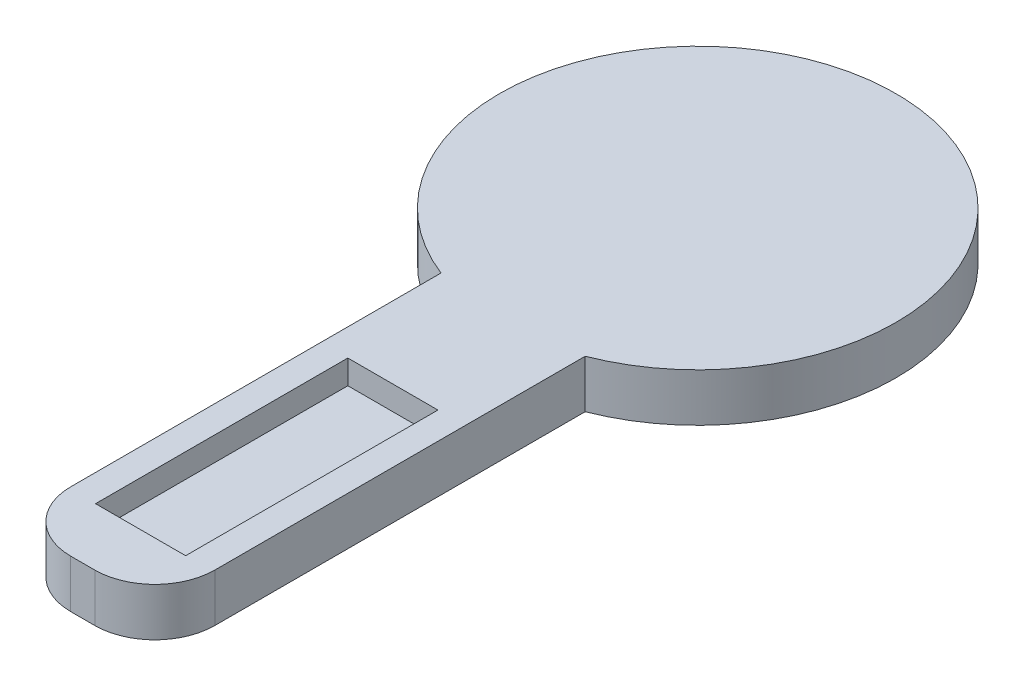
ISO-10303-21;
HEADER;
FILE_DESCRIPTION(('STEP AP214'),'2;1');
FILE_NAME('part.step','',(''),(''),'','','');
FILE_SCHEMA(('AUTOMOTIVE_DESIGN { 1 0 10303 214 1 1 1 1 }'));
ENDSEC;
DATA;
#1=APPLICATION_CONTEXT('core data for automotive mechanical design processes');
#2=APPLICATION_PROTOCOL_DEFINITION('international standard','automotive_design',2000,#1);
#3=PRODUCT_CONTEXT('',#1,'mechanical');
#4=PRODUCT('Part','Part','',(#3));
#5=PRODUCT_RELATED_PRODUCT_CATEGORY('part','',(#4));
#6=PRODUCT_DEFINITION_FORMATION('','',#4);
#7=PRODUCT_DEFINITION_CONTEXT('part definition',#1,'design');
#8=PRODUCT_DEFINITION('design','',#6,#7);
#9=PRODUCT_DEFINITION_SHAPE('','',#8);
#10=(LENGTH_UNIT() NAMED_UNIT(*) SI_UNIT(.MILLI.,.METRE.));
#11=(NAMED_UNIT(*) PLANE_ANGLE_UNIT() SI_UNIT($,.RADIAN.));
#12=(NAMED_UNIT(*) SI_UNIT($,.STERADIAN.) SOLID_ANGLE_UNIT());
#13=UNCERTAINTY_MEASURE_WITH_UNIT(LENGTH_MEASURE(1.E-05),#10,'distance_accuracy_value','');
#14=(GEOMETRIC_REPRESENTATION_CONTEXT(3) GLOBAL_UNCERTAINTY_ASSIGNED_CONTEXT((#13)) GLOBAL_UNIT_ASSIGNED_CONTEXT((#10,
#11,#12)) REPRESENTATION_CONTEXT('',''));
#15=CARTESIAN_POINT('',(0.,0.,0.));
#16=DIRECTION('',(0.,0.,1.));
#17=DIRECTION('',(1.,0.,0.));
#18=AXIS2_PLACEMENT_3D('',#15,#16,#17);
#19=CARTESIAN_POINT('',(-5.99999999999999,4.,-30.));
#20=DIRECTION('',(1.,0.,0.));
#21=DIRECTION('',(0.,0.,-1.));
#22=AXIS2_PLACEMENT_3D('',#19,#20,#21);
#23=PLANE('',#22);
#24=DIRECTION('',(0.,0.,1.));
#25=VECTOR('',#24,1.);
#26=CARTESIAN_POINT('',(-5.99999999999999,0.,-30.));
#27=LINE('',#26,#25);
#28=CARTESIAN_POINT('',(-5.99999999999999,0.,-5.8195738510606));
#29=VERTEX_POINT('',#28);
#30=CARTESIAN_POINT('',(-5.99999999999999,0.,25.));
#31=VERTEX_POINT('',#30);
#32=EDGE_CURVE('E149',#29,#31,#27,.T.);
#33=ORIENTED_EDGE('',*,*,#32,.T.);
#34=DIRECTION('',(0.,-1.,0.));
#35=VECTOR('',#34,1.);
#36=CARTESIAN_POINT('',(-5.99999999999999,4.,25.));
#37=LINE('',#36,#35);
#38=CARTESIAN_POINT('',(-5.99999999999999,4.,25.));
#39=VERTEX_POINT('',#38);
#40=EDGE_CURVE('E11',#31,#39,#37,.F.);
#41=ORIENTED_EDGE('',*,*,#40,.T.);
#42=DIRECTION('',(0.,0.,1.));
#43=VECTOR('',#42,1.);
#44=CARTESIAN_POINT('',(-5.99999999999999,4.,-30.));
#45=LINE('',#44,#43);
#46=CARTESIAN_POINT('',(-5.99999999999999,4.,-5.8195738510606));
#47=VERTEX_POINT('',#46);
#48=EDGE_CURVE('E133',#47,#39,#45,.T.);
#49=ORIENTED_EDGE('',*,*,#48,.F.);
#50=DIRECTION('',(0.,1.,0.));
#51=VECTOR('',#50,1.);
#52=CARTESIAN_POINT('',(-5.99999999999999,0.,-5.8195738510606));
#53=LINE('',#52,#51);
#54=EDGE_CURVE('E144',#47,#29,#53,.F.);
#55=ORIENTED_EDGE('',*,*,#54,.T.);
#56=EDGE_LOOP('',(#33,#41,#49,#55));
#57=FACE_BOUND('',#56,.T.);
#58=ADVANCED_FACE('F42',(#57),#23,.F.);
#59=CARTESIAN_POINT('',(-5.99999999999999,4.,30.));
#60=DIRECTION('',(0.,0.,-1.));
#61=DIRECTION('',(-1.,0.,0.));
#62=AXIS2_PLACEMENT_3D('',#59,#60,#61);
#63=PLANE('',#62);
#64=DIRECTION('',(1.,0.,0.));
#65=VECTOR('',#64,1.);
#66=CARTESIAN_POINT('',(-5.99999999999999,0.,30.));
#67=LINE('',#66,#65);
#68=CARTESIAN_POINT('',(-0.999999999999985,0.,30.));
#69=VERTEX_POINT('',#68);
#70=CARTESIAN_POINT('',(1.00000000000001,0.,30.));
#71=VERTEX_POINT('',#70);
#72=EDGE_CURVE('E134',#69,#71,#67,.T.);
#73=ORIENTED_EDGE('',*,*,#72,.T.);
#74=DIRECTION('',(0.,-1.,0.));
#75=VECTOR('',#74,1.);
#76=CARTESIAN_POINT('',(1.00000000000001,4.,30.));
#77=LINE('',#76,#75);
#78=CARTESIAN_POINT('',(1.00000000000001,4.,30.));
#79=VERTEX_POINT('',#78);
#80=EDGE_CURVE('E64',#71,#79,#77,.F.);
#81=ORIENTED_EDGE('',*,*,#80,.T.);
#82=DIRECTION('',(1.,0.,0.));
#83=VECTOR('',#82,1.);
#84=CARTESIAN_POINT('',(-5.99999999999999,4.,30.));
#85=LINE('',#84,#83);
#86=CARTESIAN_POINT('',(-0.999999999999985,4.,30.));
#87=VERTEX_POINT('',#86);
#88=EDGE_CURVE('E207',#87,#79,#85,.T.);
#89=ORIENTED_EDGE('',*,*,#88,.F.);
#90=DIRECTION('',(0.,-1.,0.));
#91=VECTOR('',#90,1.);
#92=CARTESIAN_POINT('',(-0.999999999999985,4.,30.));
#93=LINE('',#92,#91);
#94=EDGE_CURVE('E229',#87,#69,#93,.T.);
#95=ORIENTED_EDGE('',*,*,#94,.T.);
#96=EDGE_LOOP('',(#73,#81,#89,#95));
#97=FACE_BOUND('',#96,.T.);
#98=ADVANCED_FACE('F245',(#97),#63,.F.);
#99=CARTESIAN_POINT('',(6.,4.,-30.));
#100=DIRECTION('',(-1.,0.,0.));
#101=DIRECTION('',(0.,0.,1.));
#102=AXIS2_PLACEMENT_3D('',#99,#100,#101);
#103=PLANE('',#102);
#104=DIRECTION('',(0.,0.,-1.));
#105=VECTOR('',#104,1.);
#106=CARTESIAN_POINT('',(6.,4.,-30.));
#107=LINE('',#106,#105);
#108=CARTESIAN_POINT('',(6.00000000000001,4.,25.));
#109=VERTEX_POINT('',#108);
#110=CARTESIAN_POINT('',(6.00000000000001,4.,-5.8195738510606));
#111=VERTEX_POINT('',#110);
#112=EDGE_CURVE('E210',#109,#111,#107,.T.);
#113=ORIENTED_EDGE('',*,*,#112,.F.);
#114=DIRECTION('',(0.,-1.,0.));
#115=VECTOR('',#114,1.);
#116=CARTESIAN_POINT('',(6.00000000000001,4.,25.));
#117=LINE('',#116,#115);
#118=CARTESIAN_POINT('',(6.00000000000001,0.,25.));
#119=VERTEX_POINT('',#118);
#120=EDGE_CURVE('E129',#109,#119,#117,.T.);
#121=ORIENTED_EDGE('',*,*,#120,.T.);
#122=DIRECTION('',(0.,0.,-1.));
#123=VECTOR('',#122,1.);
#124=CARTESIAN_POINT('',(6.,0.,-30.));
#125=LINE('',#124,#123);
#126=CARTESIAN_POINT('',(6.00000000000001,0.,-5.8195738510606));
#127=VERTEX_POINT('',#126);
#128=EDGE_CURVE('E123',#119,#127,#125,.T.);
#129=ORIENTED_EDGE('',*,*,#128,.T.);
#130=DIRECTION('',(0.,1.,0.));
#131=VECTOR('',#130,1.);
#132=CARTESIAN_POINT('',(6.00000000000001,0.,-5.8195738510606));
#133=LINE('',#132,#131);
#134=EDGE_CURVE('E127',#127,#111,#133,.T.);
#135=ORIENTED_EDGE('',*,*,#134,.T.);
#136=EDGE_LOOP('',(#113,#121,#129,#135));
#137=FACE_BOUND('',#136,.T.);
#138=ADVANCED_FACE('F126',(#137),#103,.F.);
#139=CARTESIAN_POINT('',(0.,4.,0.));
#140=DIRECTION('',(0.,1.,0.));
#141=DIRECTION('',(0.,0.,1.));
#142=AXIS2_PLACEMENT_3D('',#139,#140,#141);
#143=PLANE('',#142);
#144=ORIENTED_EDGE('',*,*,#88,.T.);
#145=CARTESIAN_POINT('',(1.00000000000001,4.,25.));
#146=DIRECTION('',(0.,1.,0.));
#147=DIRECTION('',(0.,0.,1.));
#148=AXIS2_PLACEMENT_3D('',#145,#146,#147);
#149=CIRCLE('',#148,5.);
#150=EDGE_CURVE('E51',#79,#109,#149,.T.);
#151=ORIENTED_EDGE('',*,*,#150,.T.);
#152=ORIENTED_EDGE('',*,*,#112,.T.);
#153=CARTESIAN_POINT('',(0.,4.,-21.19));
#154=DIRECTION('',(0.,1.,0.));
#155=DIRECTION('',(0.,0.,1.));
#156=AXIS2_PLACEMENT_3D('',#153,#154,#155);
#157=CIRCLE('',#156,16.5);
#158=EDGE_CURVE('E142',#111,#47,#157,.T.);
#159=ORIENTED_EDGE('',*,*,#158,.T.);
#160=ORIENTED_EDGE('',*,*,#48,.T.);
#161=CARTESIAN_POINT('',(-0.999999999999985,4.,25.));
#162=DIRECTION('',(0.,1.,0.));
#163=DIRECTION('',(0.,0.,1.));
#164=AXIS2_PLACEMENT_3D('',#161,#162,#163);
#165=CIRCLE('',#164,5.);
#166=EDGE_CURVE('E235',#39,#87,#165,.T.);
#167=ORIENTED_EDGE('',*,*,#166,.T.);
#168=EDGE_LOOP('',(#144,#151,#152,#159,#160,#167));
#169=FACE_BOUND('',#168,.T.);
#170=DIRECTION('',(0.,0.,1.));
#171=VECTOR('',#170,1.);
#172=CARTESIAN_POINT('',(-3.75,4.,4.185));
#173=LINE('',#172,#171);
#174=CARTESIAN_POINT('',(-3.75,4.,4.185));
#175=VERTEX_POINT('',#174);
#176=CARTESIAN_POINT('',(-3.74999999999999,4.,25.185));
#177=VERTEX_POINT('',#176);
#178=EDGE_CURVE('E161',#175,#177,#173,.T.);
#179=ORIENTED_EDGE('',*,*,#178,.F.);
#180=DIRECTION('',(-1.,0.,0.));
#181=VECTOR('',#180,1.);
#182=CARTESIAN_POINT('',(-3.75,4.,4.185));
#183=LINE('',#182,#181);
#184=CARTESIAN_POINT('',(3.75,4.,4.185));
#185=VERTEX_POINT('',#184);
#186=EDGE_CURVE('E167',#185,#175,#183,.T.);
#187=ORIENTED_EDGE('',*,*,#186,.F.);
#188=DIRECTION('',(0.,0.,-1.));
#189=VECTOR('',#188,1.);
#190=CARTESIAN_POINT('',(3.75,4.,4.185));
#191=LINE('',#190,#189);
#192=CARTESIAN_POINT('',(3.75000000000001,4.,25.185));
#193=VERTEX_POINT('',#192);
#194=EDGE_CURVE('E186',#193,#185,#191,.T.);
#195=ORIENTED_EDGE('',*,*,#194,.F.);
#196=DIRECTION('',(1.,0.,0.));
#197=VECTOR('',#196,1.);
#198=CARTESIAN_POINT('',(-3.74999999999999,4.,25.185));
#199=LINE('',#198,#197);
#200=EDGE_CURVE('E182',#177,#193,#199,.T.);
#201=ORIENTED_EDGE('',*,*,#200,.F.);
#202=EDGE_LOOP('',(#179,#187,#195,#201));
#203=FACE_BOUND('',#202,.T.);
#204=ADVANCED_FACE('F240',(#169,#203),#143,.T.);
#205=CARTESIAN_POINT('',(0.,0.,0.));
#206=DIRECTION('',(0.,1.,0.));
#207=DIRECTION('',(0.,0.,1.));
#208=AXIS2_PLACEMENT_3D('',#205,#206,#207);
#209=PLANE('',#208);
#210=ORIENTED_EDGE('',*,*,#128,.F.);
#211=CARTESIAN_POINT('',(1.00000000000001,0.,25.));
#212=DIRECTION('',(0.,1.,0.));
#213=DIRECTION('',(0.,0.,1.));
#214=AXIS2_PLACEMENT_3D('',#211,#212,#213);
#215=CIRCLE('',#214,5.);
#216=EDGE_CURVE('E226',#119,#71,#215,.F.);
#217=ORIENTED_EDGE('',*,*,#216,.T.);
#218=ORIENTED_EDGE('',*,*,#72,.F.);
#219=CARTESIAN_POINT('',(-0.999999999999985,0.,25.));
#220=DIRECTION('',(0.,1.,0.));
#221=DIRECTION('',(0.,0.,1.));
#222=AXIS2_PLACEMENT_3D('',#219,#220,#221);
#223=CIRCLE('',#222,5.);
#224=EDGE_CURVE('E223',#69,#31,#223,.F.);
#225=ORIENTED_EDGE('',*,*,#224,.T.);
#226=ORIENTED_EDGE('',*,*,#32,.F.);
#227=CARTESIAN_POINT('',(0.,0.,-21.19));
#228=DIRECTION('',(0.,1.,0.));
#229=DIRECTION('',(0.,0.,1.));
#230=AXIS2_PLACEMENT_3D('',#227,#228,#229);
#231=CIRCLE('',#230,16.5);
#232=EDGE_CURVE('E139',#127,#29,#231,.T.);
#233=ORIENTED_EDGE('',*,*,#232,.F.);
#234=EDGE_LOOP('',(#210,#217,#218,#225,#226,#233));
#235=FACE_BOUND('',#234,.T.);
#236=CARTESIAN_POINT('',(0.,0.,21.18));
#237=DIRECTION('',(0.,1.,0.));
#238=DIRECTION('',(0.,0.,1.));
#239=AXIS2_PLACEMENT_3D('',#236,#237,#238);
#240=CIRCLE('',#239,3.5);
#241=CARTESIAN_POINT('',(0.,0.,24.68));
#242=VERTEX_POINT('',#241);
#243=EDGE_CURVE('E213',#242,#242,#240,.F.);
#244=ORIENTED_EDGE('',*,*,#243,.F.);
#245=EDGE_LOOP('',(#244));
#246=FACE_BOUND('',#245,.T.);
#247=ADVANCED_FACE('F147',(#235,#246),#209,.F.);
#248=CARTESIAN_POINT('',(-3.75,2.,4.185));
#249=DIRECTION('',(-1.,0.,0.));
#250=DIRECTION('',(0.,0.,1.));
#251=AXIS2_PLACEMENT_3D('',#248,#249,#250);
#252=PLANE('',#251);
#253=ORIENTED_EDGE('',*,*,#178,.T.);
#254=DIRECTION('',(0.,1.,0.));
#255=VECTOR('',#254,1.);
#256=CARTESIAN_POINT('',(-3.74999999999999,2.,25.185));
#257=LINE('',#256,#255);
#258=CARTESIAN_POINT('',(-3.74999999999999,2.,25.185));
#259=VERTEX_POINT('',#258);
#260=EDGE_CURVE('E179',#259,#177,#257,.T.);
#261=ORIENTED_EDGE('',*,*,#260,.F.);
#262=DIRECTION('',(0.,0.,1.));
#263=VECTOR('',#262,1.);
#264=CARTESIAN_POINT('',(-3.75,2.,4.185));
#265=LINE('',#264,#263);
#266=CARTESIAN_POINT('',(-3.75,2.,4.185));
#267=VERTEX_POINT('',#266);
#268=EDGE_CURVE('E162',#267,#259,#265,.T.);
#269=ORIENTED_EDGE('',*,*,#268,.F.);
#270=DIRECTION('',(0.,1.,0.));
#271=VECTOR('',#270,1.);
#272=CARTESIAN_POINT('',(-3.75,2.,4.185));
#273=LINE('',#272,#271);
#274=EDGE_CURVE('E193',#267,#175,#273,.T.);
#275=ORIENTED_EDGE('',*,*,#274,.T.);
#276=EDGE_LOOP('',(#253,#261,#269,#275));
#277=FACE_BOUND('',#276,.T.);
#278=ADVANCED_FACE('F282',(#277),#252,.F.);
#279=CARTESIAN_POINT('',(-3.75,2.,4.185));
#280=DIRECTION('',(0.,0.,-1.));
#281=DIRECTION('',(-1.,0.,0.));
#282=AXIS2_PLACEMENT_3D('',#279,#280,#281);
#283=PLANE('',#282);
#284=ORIENTED_EDGE('',*,*,#186,.T.);
#285=ORIENTED_EDGE('',*,*,#274,.F.);
#286=DIRECTION('',(-1.,0.,0.));
#287=VECTOR('',#286,1.);
#288=CARTESIAN_POINT('',(-3.75,2.,4.185));
#289=LINE('',#288,#287);
#290=CARTESIAN_POINT('',(3.75,2.,4.185));
#291=VERTEX_POINT('',#290);
#292=EDGE_CURVE('E175',#291,#267,#289,.T.);
#293=ORIENTED_EDGE('',*,*,#292,.F.);
#294=DIRECTION('',(0.,1.,0.));
#295=VECTOR('',#294,1.);
#296=CARTESIAN_POINT('',(3.75,2.,4.185));
#297=LINE('',#296,#295);
#298=EDGE_CURVE('E196',#291,#185,#297,.T.);
#299=ORIENTED_EDGE('',*,*,#298,.T.);
#300=EDGE_LOOP('',(#284,#285,#293,#299));
#301=FACE_BOUND('',#300,.T.);
#302=ADVANCED_FACE('F278',(#301),#283,.F.);
#303=CARTESIAN_POINT('',(3.75,2.,4.185));
#304=DIRECTION('',(1.,0.,0.));
#305=DIRECTION('',(0.,0.,-1.));
#306=AXIS2_PLACEMENT_3D('',#303,#304,#305);
#307=PLANE('',#306);
#308=ORIENTED_EDGE('',*,*,#194,.T.);
#309=ORIENTED_EDGE('',*,*,#298,.F.);
#310=DIRECTION('',(0.,0.,-1.));
#311=VECTOR('',#310,1.);
#312=CARTESIAN_POINT('',(3.75,2.,4.185));
#313=LINE('',#312,#311);
#314=CARTESIAN_POINT('',(3.75000000000001,2.,25.185));
#315=VERTEX_POINT('',#314);
#316=EDGE_CURVE('E171',#315,#291,#313,.T.);
#317=ORIENTED_EDGE('',*,*,#316,.F.);
#318=DIRECTION('',(0.,1.,0.));
#319=VECTOR('',#318,1.);
#320=CARTESIAN_POINT('',(3.75000000000001,2.,25.185));
#321=LINE('',#320,#319);
#322=EDGE_CURVE('E199',#315,#193,#321,.T.);
#323=ORIENTED_EDGE('',*,*,#322,.T.);
#324=EDGE_LOOP('',(#308,#309,#317,#323));
#325=FACE_BOUND('',#324,.T.);
#326=ADVANCED_FACE('F281',(#325),#307,.F.);
#327=CARTESIAN_POINT('',(-3.74999999999999,2.,25.185));
#328=DIRECTION('',(0.,0.,1.));
#329=DIRECTION('',(1.,0.,0.));
#330=AXIS2_PLACEMENT_3D('',#327,#328,#329);
#331=PLANE('',#330);
#332=ORIENTED_EDGE('',*,*,#200,.T.);
#333=ORIENTED_EDGE('',*,*,#322,.F.);
#334=DIRECTION('',(1.,0.,0.));
#335=VECTOR('',#334,1.);
#336=CARTESIAN_POINT('',(-3.74999999999999,2.,25.185));
#337=LINE('',#336,#335);
#338=EDGE_CURVE('E166',#259,#315,#337,.T.);
#339=ORIENTED_EDGE('',*,*,#338,.F.);
#340=ORIENTED_EDGE('',*,*,#260,.T.);
#341=EDGE_LOOP('',(#332,#333,#339,#340));
#342=FACE_BOUND('',#341,.T.);
#343=ADVANCED_FACE('F276',(#342),#331,.F.);
#344=CARTESIAN_POINT('',(0.,2.,0.));
#345=DIRECTION('',(0.,1.,0.));
#346=DIRECTION('',(0.,0.,1.));
#347=AXIS2_PLACEMENT_3D('',#344,#345,#346);
#348=PLANE('',#347);
#349=ORIENTED_EDGE('',*,*,#268,.T.);
#350=ORIENTED_EDGE('',*,*,#338,.T.);
#351=ORIENTED_EDGE('',*,*,#316,.T.);
#352=ORIENTED_EDGE('',*,*,#292,.T.);
#353=EDGE_LOOP('',(#349,#350,#351,#352));
#354=FACE_BOUND('',#353,.T.);
#355=ADVANCED_FACE('F272',(#354),#348,.T.);
#356=CARTESIAN_POINT('',(0.,-1.,21.18));
#357=DIRECTION('',(0.,1.,0.));
#358=DIRECTION('',(0.,0.,1.));
#359=AXIS2_PLACEMENT_3D('',#356,#357,#358);
#360=CYLINDRICAL_SURFACE('',#359,3.5);
#361=CARTESIAN_POINT('',(0.,-1.,21.18));
#362=DIRECTION('',(0.,-1.,0.));
#363=DIRECTION('',(0.,0.,-1.));
#364=AXIS2_PLACEMENT_3D('',#361,#362,#363);
#365=CIRCLE('',#364,3.5);
#366=CARTESIAN_POINT('',(0.,-1.,17.68));
#367=VERTEX_POINT('',#366);
#368=EDGE_CURVE('E157',#367,#367,#365,.T.);
#369=ORIENTED_EDGE('',*,*,#368,.F.);
#370=EDGE_LOOP('',(#369));
#371=FACE_BOUND('',#370,.T.);
#372=ORIENTED_EDGE('',*,*,#243,.T.);
#373=EDGE_LOOP('',(#372));
#374=FACE_BOUND('',#373,.T.);
#375=ADVANCED_FACE('F266',(#371,#374),#360,.T.);
#376=CARTESIAN_POINT('',(0.,-1.,21.18));
#377=DIRECTION('',(0.,-1.,0.));
#378=DIRECTION('',(0.,0.,-1.));
#379=AXIS2_PLACEMENT_3D('',#376,#377,#378);
#380=PLANE('',#379);
#381=ORIENTED_EDGE('',*,*,#368,.T.);
#382=EDGE_LOOP('',(#381));
#383=FACE_BOUND('',#382,.T.);
#384=ADVANCED_FACE('F261',(#383),#380,.T.);
#385=CARTESIAN_POINT('',(0.,0.,-21.19));
#386=DIRECTION('',(0.,1.,0.));
#387=DIRECTION('',(0.,0.,1.));
#388=AXIS2_PLACEMENT_3D('',#385,#386,#387);
#389=CYLINDRICAL_SURFACE('',#388,16.5);
#390=ORIENTED_EDGE('',*,*,#54,.F.);
#391=ORIENTED_EDGE('',*,*,#158,.F.);
#392=ORIENTED_EDGE('',*,*,#134,.F.);
#393=ORIENTED_EDGE('',*,*,#232,.T.);
#394=EDGE_LOOP('',(#390,#391,#392,#393));
#395=FACE_BOUND('',#394,.T.);
#396=ADVANCED_FACE('F138',(#395),#389,.T.);
#397=CARTESIAN_POINT('',(1.00000000000001,4.,25.));
#398=DIRECTION('',(0.,-1.,0.));
#399=DIRECTION('',(0.,0.,-1.));
#400=AXIS2_PLACEMENT_3D('',#397,#398,#399);
#401=CYLINDRICAL_SURFACE('',#400,5.);
#402=ORIENTED_EDGE('',*,*,#150,.F.);
#403=ORIENTED_EDGE('',*,*,#80,.F.);
#404=ORIENTED_EDGE('',*,*,#216,.F.);
#405=ORIENTED_EDGE('',*,*,#120,.F.);
#406=EDGE_LOOP('',(#402,#403,#404,#405));
#407=FACE_BOUND('',#406,.T.);
#408=ADVANCED_FACE('F243',(#407),#401,.T.);
#409=CARTESIAN_POINT('',(-0.999999999999985,4.,25.));
#410=DIRECTION('',(0.,-1.,0.));
#411=DIRECTION('',(0.,0.,-1.));
#412=AXIS2_PLACEMENT_3D('',#409,#410,#411);
#413=CYLINDRICAL_SURFACE('',#412,5.);
#414=ORIENTED_EDGE('',*,*,#166,.F.);
#415=ORIENTED_EDGE('',*,*,#40,.F.);
#416=ORIENTED_EDGE('',*,*,#224,.F.);
#417=ORIENTED_EDGE('',*,*,#94,.F.);
#418=EDGE_LOOP('',(#414,#415,#416,#417));
#419=FACE_BOUND('',#418,.T.);
#420=ADVANCED_FACE('F44',(#419),#413,.T.);
#421=CLOSED_SHELL('',(#58,#98,#138,#204,#247,#278,#302,#326,#343,#355,#375,#384,#396,#408,#420));
#422=MANIFOLD_SOLID_BREP('B2',#421);
#423=ADVANCED_BREP_SHAPE_REPRESENTATION('',(#18,#422),#14);
#424=SHAPE_DEFINITION_REPRESENTATION(#9,#423);
ENDSEC;
END-ISO-10303-21;
